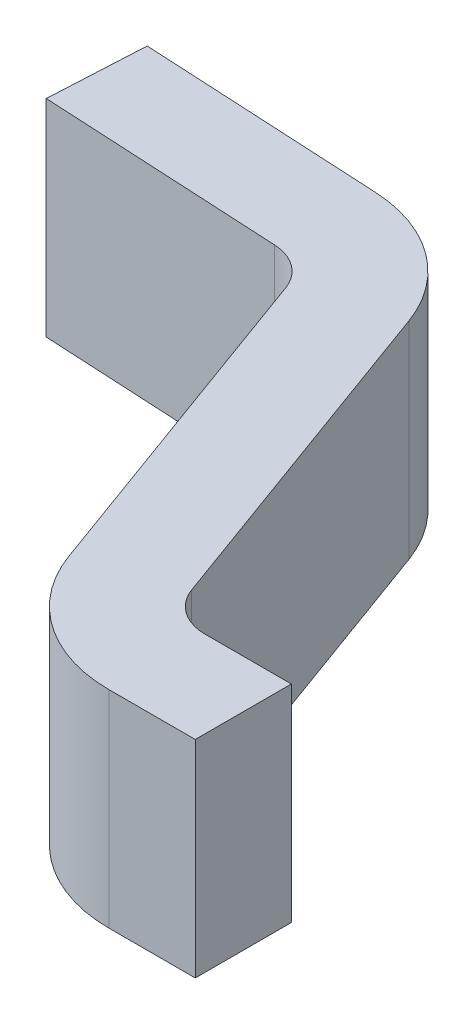
ISO-10303-21;
HEADER;
FILE_DESCRIPTION(('STEP AP214'),'2;1');
FILE_NAME('part.step','',(''),(''),'','','');
FILE_SCHEMA(('AUTOMOTIVE_DESIGN { 1 0 10303 214 1 1 1 1 }'));
ENDSEC;
DATA;
#1=APPLICATION_CONTEXT('core data for automotive mechanical design processes');
#2=APPLICATION_PROTOCOL_DEFINITION('international standard','automotive_design',2000,#1);
#3=PRODUCT_CONTEXT('',#1,'mechanical');
#4=PRODUCT('Part','Part','',(#3));
#5=PRODUCT_RELATED_PRODUCT_CATEGORY('part','',(#4));
#6=PRODUCT_DEFINITION_FORMATION('','',#4);
#7=PRODUCT_DEFINITION_CONTEXT('part definition',#1,'design');
#8=PRODUCT_DEFINITION('design','',#6,#7);
#9=PRODUCT_DEFINITION_SHAPE('','',#8);
#10=(LENGTH_UNIT() NAMED_UNIT(*) SI_UNIT(.MILLI.,.METRE.));
#11=(NAMED_UNIT(*) PLANE_ANGLE_UNIT() SI_UNIT($,.RADIAN.));
#12=(NAMED_UNIT(*) SI_UNIT($,.STERADIAN.) SOLID_ANGLE_UNIT());
#13=UNCERTAINTY_MEASURE_WITH_UNIT(LENGTH_MEASURE(1.E-05),#10,'distance_accuracy_value','');
#14=(GEOMETRIC_REPRESENTATION_CONTEXT(3) GLOBAL_UNCERTAINTY_ASSIGNED_CONTEXT((#13)) GLOBAL_UNIT_ASSIGNED_CONTEXT((#10,
#11,#12)) REPRESENTATION_CONTEXT('',''));
#15=CARTESIAN_POINT('',(0.,0.,0.));
#16=DIRECTION('',(0.,0.,1.));
#17=DIRECTION('',(1.,0.,0.));
#18=AXIS2_PLACEMENT_3D('',#15,#16,#17);
#19=CARTESIAN_POINT('',(0.48600567211583,0.,0.323785336125864));
#20=DIRECTION('',(0.,-1.,0.));
#21=DIRECTION('',(0.,0.,-1.));
#22=AXIS2_PLACEMENT_3D('',#19,#20,#21);
#23=PLANE('',#22);
#24=DIRECTION('',(0.998629534754574,0.,0.052335956242944));
#25=VECTOR('',#24,1.);
#26=CARTESIAN_POINT('',(0.491239267740124,0.,0.223922382650406));
#27=LINE('',#26,#25);
#28=CARTESIAN_POINT('',(-0.010467191248589,0.,0.19762906128285));
#29=VERTEX_POINT('',#28);
#30=CARTESIAN_POINT('',(0.491239267740124,0.,0.223922382650406));
#31=VERTEX_POINT('',#30);
#32=EDGE_CURVE('E149',#29,#31,#27,.T.);
#33=ORIENTED_EDGE('',*,*,#32,.T.);
#34=CARTESIAN_POINT('',(0.48600567211583,0.,0.323785336125864));
#35=DIRECTION('',(0.,-1.,0.));
#36=DIRECTION('',(0.,0.,1.));
#37=AXIS2_PLACEMENT_3D('',#34,#35,#36);
#38=CIRCLE('',#37,0.1);
#39=CARTESIAN_POINT('',(0.57997493419442,0.,0.289583321793297));
#40=VERTEX_POINT('',#39);
#41=EDGE_CURVE('E160',#31,#40,#38,.T.);
#42=ORIENTED_EDGE('',*,*,#41,.T.);
#43=DIRECTION('',(0.342020143325669,0.,0.939692620785908));
#44=VECTOR('',#43,1.);
#45=CARTESIAN_POINT('',(0.838730791659287,0.,1.00050919732964));
#46=LINE('',#45,#44);
#47=CARTESIAN_POINT('',(0.838730791659286,0.,1.00050919732964));
#48=VERTEX_POINT('',#47);
#49=EDGE_CURVE('E159',#40,#48,#46,.T.);
#50=ORIENTED_EDGE('',*,*,#49,.T.);
#51=CARTESIAN_POINT('',(1.12063857789506,0.,0.897903154331935));
#52=DIRECTION('',(0.,-1.,0.));
#53=DIRECTION('',(0.,0.,1.));
#54=AXIS2_PLACEMENT_3D('',#51,#52,#53);
#55=CIRCLE('',#54,0.3);
#56=CARTESIAN_POINT('',(1.12063857789506,0.,1.19790315433193));
#57=VERTEX_POINT('',#56);
#58=EDGE_CURVE('E196',#57,#48,#55,.T.);
#59=ORIENTED_EDGE('',*,*,#58,.F.);
#60=DIRECTION('',(1.,0.,0.));
#61=VECTOR('',#60,1.);
#62=CARTESIAN_POINT('',(1.3,0.,1.19790315433193));
#63=LINE('',#62,#61);
#64=CARTESIAN_POINT('',(1.3,0.,1.19790315433193));
#65=VERTEX_POINT('',#64);
#66=EDGE_CURVE('E207',#57,#65,#63,.T.);
#67=ORIENTED_EDGE('',*,*,#66,.T.);
#68=DIRECTION('',(0.,0.,-1.));
#69=VECTOR('',#68,1.);
#70=CARTESIAN_POINT('',(1.3,0.,0.997903154331935));
#71=LINE('',#70,#69);
#72=CARTESIAN_POINT('',(1.3,0.,0.997903154331935));
#73=VERTEX_POINT('',#72);
#74=EDGE_CURVE('E225',#65,#73,#71,.T.);
#75=ORIENTED_EDGE('',*,*,#74,.T.);
#76=DIRECTION('',(-1.,0.,0.));
#77=VECTOR('',#76,1.);
#78=CARTESIAN_POINT('',(1.12063857789506,0.,0.997903154331935));
#79=LINE('',#78,#77);
#80=CARTESIAN_POINT('',(1.12063857789506,0.,0.997903154331935));
#81=VERTEX_POINT('',#80);
#82=EDGE_CURVE('E165',#73,#81,#79,.T.);
#83=ORIENTED_EDGE('',*,*,#82,.T.);
#84=CARTESIAN_POINT('',(1.12063857789506,0.,0.897903154331935));
#85=DIRECTION('',(0.,-1.,0.));
#86=DIRECTION('',(0.,0.,1.));
#87=AXIS2_PLACEMENT_3D('',#84,#85,#86);
#88=CIRCLE('',#87,0.1);
#89=CARTESIAN_POINT('',(1.02666931581647,0.,0.932105168664502));
#90=VERTEX_POINT('',#89);
#91=EDGE_CURVE('E164',#81,#90,#88,.T.);
#92=ORIENTED_EDGE('',*,*,#91,.T.);
#93=DIRECTION('',(-0.342020143325669,0.,-0.939692620785908));
#94=VECTOR('',#93,1.);
#95=CARTESIAN_POINT('',(0.767913458351602,0.,0.221179293128163));
#96=LINE('',#95,#94);
#97=CARTESIAN_POINT('',(0.767913458351602,0.,0.221179293128163));
#98=VERTEX_POINT('',#97);
#99=EDGE_CURVE('E123',#90,#98,#96,.T.);
#100=ORIENTED_EDGE('',*,*,#99,.T.);
#101=CARTESIAN_POINT('',(0.48600567211583,0.,0.323785336125864));
#102=DIRECTION('',(0.,-1.,0.));
#103=DIRECTION('',(0.,0.,1.));
#104=AXIS2_PLACEMENT_3D('',#101,#102,#103);
#105=CIRCLE('',#104,0.3);
#106=CARTESIAN_POINT('',(0.501706458988713,0.,0.0241964756994916));
#107=VERTEX_POINT('',#106);
#108=EDGE_CURVE('E122',#107,#98,#105,.T.);
#109=ORIENTED_EDGE('',*,*,#108,.F.);
#110=DIRECTION('',(-0.998629534754574,0.,-0.052335956242944));
#111=VECTOR('',#110,1.);
#112=CARTESIAN_POINT('',(0.,0.,-0.00209684566806524));
#113=LINE('',#112,#111);
#114=CARTESIAN_POINT('',(0.,0.,-0.00209684566806525));
#115=VERTEX_POINT('',#114);
#116=EDGE_CURVE('E26',#107,#115,#113,.T.);
#117=ORIENTED_EDGE('',*,*,#116,.T.);
#118=DIRECTION('',(-0.0523359562429441,0.,0.998629534754574));
#119=VECTOR('',#118,1.);
#120=CARTESIAN_POINT('',(-0.0104671912485889,0.,0.19762906128285));
#121=LINE('',#120,#119);
#122=EDGE_CURVE('E11',#115,#29,#121,.T.);
#123=ORIENTED_EDGE('',*,*,#122,.T.);
#124=EDGE_LOOP('',(#33,#42,#50,#59,#67,#75,#83,#92,#100,#109,#117,#123));
#125=FACE_BOUND('',#124,.T.);
#126=ADVANCED_FACE('F16',(#125),#23,.F.);
#127=CARTESIAN_POINT('',(-0.0104671912485889,-0.43,0.19762906128285));
#128=DIRECTION('',(0.998629534754574,0.,0.0523359562429441));
#129=DIRECTION('',(0.,-1.,0.));
#130=AXIS2_PLACEMENT_3D('',#127,#128,#129);
#131=PLANE('',#130);
#132=DIRECTION('',(0.,-1.,0.));
#133=VECTOR('',#132,1.);
#134=CARTESIAN_POINT('',(0.,-0.43,-0.00209684566806524));
#135=LINE('',#134,#133);
#136=CARTESIAN_POINT('',(0.,-0.43,-0.00209684566806522));
#137=VERTEX_POINT('',#136);
#138=EDGE_CURVE('E227',#115,#137,#135,.T.);
#139=ORIENTED_EDGE('',*,*,#138,.T.);
#140=DIRECTION('',(0.0523359562429436,0.,-0.998629534754574));
#141=VECTOR('',#140,1.);
#142=CARTESIAN_POINT('',(-0.0104671912485889,-0.43,0.19762906128285));
#143=LINE('',#142,#141);
#144=CARTESIAN_POINT('',(-0.0104671912485889,-0.43,0.19762906128285));
#145=VERTEX_POINT('',#144);
#146=EDGE_CURVE('E137',#145,#137,#143,.T.);
#147=ORIENTED_EDGE('',*,*,#146,.F.);
#148=DIRECTION('',(0.,1.,0.));
#149=VECTOR('',#148,1.);
#150=CARTESIAN_POINT('',(-0.010467191248589,-0.43,0.197629061282849));
#151=LINE('',#150,#149);
#152=EDGE_CURVE('E169',#145,#29,#151,.T.);
#153=ORIENTED_EDGE('',*,*,#152,.T.);
#154=ORIENTED_EDGE('',*,*,#122,.F.);
#155=EDGE_LOOP('',(#139,#147,#153,#154));
#156=FACE_BOUND('',#155,.T.);
#157=ADVANCED_FACE('F302',(#156),#131,.F.);
#158=CARTESIAN_POINT('',(0.,-0.43,-0.00209684566806524));
#159=DIRECTION('',(-0.052335956242944,0.,0.998629534754574));
#160=DIRECTION('',(0.,1.,0.));
#161=AXIS2_PLACEMENT_3D('',#158,#159,#160);
#162=PLANE('',#161);
#163=DIRECTION('',(0.,1.,0.));
#164=VECTOR('',#163,1.);
#165=CARTESIAN_POINT('',(0.501706458988713,-0.43,0.0241964756994918));
#166=LINE('',#165,#164);
#167=CARTESIAN_POINT('',(0.501706458988713,-0.43,0.0241964756994917));
#168=VERTEX_POINT('',#167);
#169=EDGE_CURVE('E114',#168,#107,#166,.T.);
#170=ORIENTED_EDGE('',*,*,#169,.F.);
#171=DIRECTION('',(0.998629534754574,0.,0.0523359562429439));
#172=VECTOR('',#171,1.);
#173=CARTESIAN_POINT('',(0.,-0.43,-0.00209684566806519));
#174=LINE('',#173,#172);
#175=EDGE_CURVE('E118',#137,#168,#174,.T.);
#176=ORIENTED_EDGE('',*,*,#175,.F.);
#177=ORIENTED_EDGE('',*,*,#138,.F.);
#178=ORIENTED_EDGE('',*,*,#116,.F.);
#179=EDGE_LOOP('',(#170,#176,#177,#178));
#180=FACE_BOUND('',#179,.T.);
#181=ADVANCED_FACE('F115',(#180),#162,.F.);
#182=CARTESIAN_POINT('',(0.48600567211583,-0.43,0.323785336125864));
#183=DIRECTION('',(0.,1.,0.));
#184=DIRECTION('',(0.,0.,1.));
#185=AXIS2_PLACEMENT_3D('',#182,#183,#184);
#186=CYLINDRICAL_SURFACE('',#185,0.3);
#187=CARTESIAN_POINT('',(0.48600567211583,-0.43,0.323785336125864));
#188=DIRECTION('',(0.,-1.,0.));
#189=DIRECTION('',(0.,0.,1.));
#190=AXIS2_PLACEMENT_3D('',#187,#188,#189);
#191=CIRCLE('',#190,0.3);
#192=CARTESIAN_POINT('',(0.767913458351602,-0.43,0.221179293128163));
#193=VERTEX_POINT('',#192);
#194=EDGE_CURVE('E126',#168,#193,#191,.T.);
#195=ORIENTED_EDGE('',*,*,#194,.F.);
#196=ORIENTED_EDGE('',*,*,#169,.T.);
#197=ORIENTED_EDGE('',*,*,#108,.T.);
#198=DIRECTION('',(0.,-1.,0.));
#199=VECTOR('',#198,1.);
#200=CARTESIAN_POINT('',(0.767913458351602,-0.43,0.221179293128163));
#201=LINE('',#200,#199);
#202=EDGE_CURVE('E105',#98,#193,#201,.T.);
#203=ORIENTED_EDGE('',*,*,#202,.T.);
#204=EDGE_LOOP('',(#195,#196,#197,#203));
#205=FACE_BOUND('',#204,.T.);
#206=ADVANCED_FACE('F127',(#205),#186,.T.);
#207=CARTESIAN_POINT('',(0.767913458351602,-0.43,0.221179293128163));
#208=DIRECTION('',(-0.939692620785908,0.,0.342020143325669));
#209=DIRECTION('',(0.,1.,0.));
#210=AXIS2_PLACEMENT_3D('',#207,#208,#209);
#211=PLANE('',#210);
#212=DIRECTION('',(0.,-1.,0.));
#213=VECTOR('',#212,1.);
#214=CARTESIAN_POINT('',(1.02666931581647,-0.43,0.932105168664502));
#215=LINE('',#214,#213);
#216=CARTESIAN_POINT('',(1.02666931581647,-0.43,0.932105168664502));
#217=VERTEX_POINT('',#216);
#218=EDGE_CURVE('E161',#90,#217,#215,.T.);
#219=ORIENTED_EDGE('',*,*,#218,.T.);
#220=DIRECTION('',(0.342020143325671,0.,0.939692620785908));
#221=VECTOR('',#220,1.);
#222=CARTESIAN_POINT('',(0.767913458351602,-0.43,0.221179293128163));
#223=LINE('',#222,#221);
#224=EDGE_CURVE('E131',#193,#217,#223,.T.);
#225=ORIENTED_EDGE('',*,*,#224,.F.);
#226=ORIENTED_EDGE('',*,*,#202,.F.);
#227=ORIENTED_EDGE('',*,*,#99,.F.);
#228=EDGE_LOOP('',(#219,#225,#226,#227));
#229=FACE_BOUND('',#228,.T.);
#230=ADVANCED_FACE('F301',(#229),#211,.F.);
#231=CARTESIAN_POINT('',(1.12063857789506,-0.43,0.897903154331935));
#232=DIRECTION('',(0.,1.,0.));
#233=DIRECTION('',(0.,0.,1.));
#234=AXIS2_PLACEMENT_3D('',#231,#232,#233);
#235=CYLINDRICAL_SURFACE('',#234,0.1);
#236=DIRECTION('',(0.,-1.,0.));
#237=VECTOR('',#236,1.);
#238=CARTESIAN_POINT('',(1.12063857789506,-0.43,0.997903154331935));
#239=LINE('',#238,#237);
#240=CARTESIAN_POINT('',(1.12063857789506,-0.43,0.997903154331935));
#241=VERTEX_POINT('',#240);
#242=EDGE_CURVE('E218',#81,#241,#239,.T.);
#243=ORIENTED_EDGE('',*,*,#242,.T.);
#244=CARTESIAN_POINT('',(1.12063857789506,-0.43,0.897903154331935));
#245=DIRECTION('',(0.,1.,0.));
#246=DIRECTION('',(0.,0.,1.));
#247=AXIS2_PLACEMENT_3D('',#244,#245,#246);
#248=CIRCLE('',#247,0.1);
#249=EDGE_CURVE('E184',#217,#241,#248,.T.);
#250=ORIENTED_EDGE('',*,*,#249,.F.);
#251=ORIENTED_EDGE('',*,*,#218,.F.);
#252=ORIENTED_EDGE('',*,*,#91,.F.);
#253=EDGE_LOOP('',(#243,#250,#251,#252));
#254=FACE_BOUND('',#253,.T.);
#255=ADVANCED_FACE('F296',(#254),#235,.F.);
#256=CARTESIAN_POINT('',(1.12063857789506,-0.43,0.997903154331935));
#257=DIRECTION('',(0.,0.,1.));
#258=DIRECTION('',(1.,0.,0.));
#259=AXIS2_PLACEMENT_3D('',#256,#257,#258);
#260=PLANE('',#259);
#261=DIRECTION('',(0.,-1.,0.));
#262=VECTOR('',#261,1.);
#263=CARTESIAN_POINT('',(1.3,-0.43,0.997903154331935));
#264=LINE('',#263,#262);
#265=CARTESIAN_POINT('',(1.3,-0.43,0.997903154331935));
#266=VERTEX_POINT('',#265);
#267=EDGE_CURVE('E211',#73,#266,#264,.T.);
#268=ORIENTED_EDGE('',*,*,#267,.T.);
#269=DIRECTION('',(1.,0.,0.));
#270=VECTOR('',#269,1.);
#271=CARTESIAN_POINT('',(0.48600567211583,-0.43,0.997903154331935));
#272=LINE('',#271,#270);
#273=EDGE_CURVE('E179',#241,#266,#272,.T.);
#274=ORIENTED_EDGE('',*,*,#273,.F.);
#275=ORIENTED_EDGE('',*,*,#242,.F.);
#276=ORIENTED_EDGE('',*,*,#82,.F.);
#277=EDGE_LOOP('',(#268,#274,#275,#276));
#278=FACE_BOUND('',#277,.T.);
#279=ADVANCED_FACE('F298',(#278),#260,.F.);
#280=CARTESIAN_POINT('',(1.3,-0.43,0.997903154331935));
#281=DIRECTION('',(-1.,0.,0.));
#282=DIRECTION('',(0.,0.,1.));
#283=AXIS2_PLACEMENT_3D('',#280,#281,#282);
#284=PLANE('',#283);
#285=DIRECTION('',(0.,-1.,0.));
#286=VECTOR('',#285,1.);
#287=CARTESIAN_POINT('',(1.3,-0.43,1.19790315433193));
#288=LINE('',#287,#286);
#289=CARTESIAN_POINT('',(1.3,-0.43,1.19790315433193));
#290=VERTEX_POINT('',#289);
#291=EDGE_CURVE('E200',#65,#290,#288,.T.);
#292=ORIENTED_EDGE('',*,*,#291,.T.);
#293=DIRECTION('',(0.,0.,1.));
#294=VECTOR('',#293,1.);
#295=CARTESIAN_POINT('',(1.3,-0.43,0.323785336125864));
#296=LINE('',#295,#294);
#297=EDGE_CURVE('E183',#266,#290,#296,.T.);
#298=ORIENTED_EDGE('',*,*,#297,.F.);
#299=ORIENTED_EDGE('',*,*,#267,.F.);
#300=ORIENTED_EDGE('',*,*,#74,.F.);
#301=EDGE_LOOP('',(#292,#298,#299,#300));
#302=FACE_BOUND('',#301,.T.);
#303=ADVANCED_FACE('F477',(#302),#284,.F.);
#304=CARTESIAN_POINT('',(1.3,-0.43,1.19790315433193));
#305=DIRECTION('',(0.,0.,-1.));
#306=DIRECTION('',(-1.,0.,0.));
#307=AXIS2_PLACEMENT_3D('',#304,#305,#306);
#308=PLANE('',#307);
#309=DIRECTION('',(0.,1.,0.));
#310=VECTOR('',#309,1.);
#311=CARTESIAN_POINT('',(1.12063857789506,-0.43,1.19790315433193));
#312=LINE('',#311,#310);
#313=CARTESIAN_POINT('',(1.12063857789506,-0.43,1.19790315433193));
#314=VERTEX_POINT('',#313);
#315=EDGE_CURVE('E192',#314,#57,#312,.T.);
#316=ORIENTED_EDGE('',*,*,#315,.F.);
#317=DIRECTION('',(-1.,0.,0.));
#318=VECTOR('',#317,1.);
#319=CARTESIAN_POINT('',(0.48600567211583,-0.43,1.19790315433193));
#320=LINE('',#319,#318);
#321=EDGE_CURVE('E185',#290,#314,#320,.T.);
#322=ORIENTED_EDGE('',*,*,#321,.F.);
#323=ORIENTED_EDGE('',*,*,#291,.F.);
#324=ORIENTED_EDGE('',*,*,#66,.F.);
#325=EDGE_LOOP('',(#316,#322,#323,#324));
#326=FACE_BOUND('',#325,.T.);
#327=ADVANCED_FACE('F18',(#326),#308,.F.);
#328=CARTESIAN_POINT('',(1.12063857789506,-0.43,0.897903154331935));
#329=DIRECTION('',(0.,1.,0.));
#330=DIRECTION('',(0.,0.,1.));
#331=AXIS2_PLACEMENT_3D('',#328,#329,#330);
#332=CYLINDRICAL_SURFACE('',#331,0.3);
#333=CARTESIAN_POINT('',(1.12063857789506,-0.43,0.897903154331935));
#334=DIRECTION('',(0.,-1.,0.));
#335=DIRECTION('',(0.,0.,1.));
#336=AXIS2_PLACEMENT_3D('',#333,#334,#335);
#337=CIRCLE('',#336,0.3);
#338=CARTESIAN_POINT('',(0.838730791659286,-0.43,1.00050919732964));
#339=VERTEX_POINT('',#338);
#340=EDGE_CURVE('E178',#314,#339,#337,.T.);
#341=ORIENTED_EDGE('',*,*,#340,.F.);
#342=ORIENTED_EDGE('',*,*,#315,.T.);
#343=ORIENTED_EDGE('',*,*,#58,.T.);
#344=DIRECTION('',(0.,-1.,0.));
#345=VECTOR('',#344,1.);
#346=CARTESIAN_POINT('',(0.838730791659287,-0.43,1.00050919732964));
#347=LINE('',#346,#345);
#348=EDGE_CURVE('E155',#48,#339,#347,.T.);
#349=ORIENTED_EDGE('',*,*,#348,.T.);
#350=EDGE_LOOP('',(#341,#342,#343,#349));
#351=FACE_BOUND('',#350,.T.);
#352=ADVANCED_FACE('F280',(#351),#332,.T.);
#353=CARTESIAN_POINT('',(0.838730791659287,-0.43,1.00050919732964));
#354=DIRECTION('',(0.939692620785908,0.,-0.342020143325669));
#355=DIRECTION('',(0.,-1.,0.));
#356=AXIS2_PLACEMENT_3D('',#353,#354,#355);
#357=PLANE('',#356);
#358=DIRECTION('',(0.,-1.,0.));
#359=VECTOR('',#358,1.);
#360=CARTESIAN_POINT('',(0.579974934194421,-0.43,0.289583321793297));
#361=LINE('',#360,#359);
#362=CARTESIAN_POINT('',(0.579974934194421,-0.43,0.289583321793297));
#363=VERTEX_POINT('',#362);
#364=EDGE_CURVE('E153',#40,#363,#361,.T.);
#365=ORIENTED_EDGE('',*,*,#364,.T.);
#366=DIRECTION('',(-0.342020143325667,0.,-0.939692620785909));
#367=VECTOR('',#366,1.);
#368=CARTESIAN_POINT('',(0.838730791659287,-0.43,1.00050919732964));
#369=LINE('',#368,#367);
#370=EDGE_CURVE('E172',#339,#363,#369,.T.);
#371=ORIENTED_EDGE('',*,*,#370,.F.);
#372=ORIENTED_EDGE('',*,*,#348,.F.);
#373=ORIENTED_EDGE('',*,*,#49,.F.);
#374=EDGE_LOOP('',(#365,#371,#372,#373));
#375=FACE_BOUND('',#374,.T.);
#376=ADVANCED_FACE('F274',(#375),#357,.F.);
#377=CARTESIAN_POINT('',(0.48600567211583,-0.43,0.323785336125864));
#378=DIRECTION('',(0.,1.,0.));
#379=DIRECTION('',(0.,0.,1.));
#380=AXIS2_PLACEMENT_3D('',#377,#378,#379);
#381=CYLINDRICAL_SURFACE('',#380,0.1);
#382=DIRECTION('',(0.,-1.,0.));
#383=VECTOR('',#382,1.);
#384=CARTESIAN_POINT('',(0.491239267740124,-0.43,0.223922382650406));
#385=LINE('',#384,#383);
#386=CARTESIAN_POINT('',(0.491239267740124,-0.43,0.223922382650406));
#387=VERTEX_POINT('',#386);
#388=EDGE_CURVE('E154',#31,#387,#385,.T.);
#389=ORIENTED_EDGE('',*,*,#388,.T.);
#390=CARTESIAN_POINT('',(0.48600567211583,-0.43,0.323785336125864));
#391=DIRECTION('',(0.,1.,0.));
#392=DIRECTION('',(0.,0.,1.));
#393=AXIS2_PLACEMENT_3D('',#390,#391,#392);
#394=CIRCLE('',#393,0.1);
#395=EDGE_CURVE('E189',#363,#387,#394,.T.);
#396=ORIENTED_EDGE('',*,*,#395,.F.);
#397=ORIENTED_EDGE('',*,*,#364,.F.);
#398=ORIENTED_EDGE('',*,*,#41,.F.);
#399=EDGE_LOOP('',(#389,#396,#397,#398));
#400=FACE_BOUND('',#399,.T.);
#401=ADVANCED_FACE('F271',(#400),#381,.F.);
#402=CARTESIAN_POINT('',(0.491239267740124,-0.43,0.223922382650406));
#403=DIRECTION('',(0.052335956242944,0.,-0.998629534754574));
#404=DIRECTION('',(0.,-1.,0.));
#405=AXIS2_PLACEMENT_3D('',#402,#403,#404);
#406=PLANE('',#405);
#407=ORIENTED_EDGE('',*,*,#152,.F.);
#408=DIRECTION('',(-0.998629534754574,0.,-0.0523359562429426));
#409=VECTOR('',#408,1.);
#410=CARTESIAN_POINT('',(0.491239267740124,-0.43,0.223922382650406));
#411=LINE('',#410,#409);
#412=EDGE_CURVE('E144',#387,#145,#411,.T.);
#413=ORIENTED_EDGE('',*,*,#412,.F.);
#414=ORIENTED_EDGE('',*,*,#388,.F.);
#415=ORIENTED_EDGE('',*,*,#32,.F.);
#416=EDGE_LOOP('',(#407,#413,#414,#415));
#417=FACE_BOUND('',#416,.T.);
#418=ADVANCED_FACE('F416',(#417),#406,.F.);
#419=CARTESIAN_POINT('',(0.48600567211583,-0.43,0.323785336125864));
#420=DIRECTION('',(0.,-1.,0.));
#421=DIRECTION('',(0.,0.,-1.));
#422=AXIS2_PLACEMENT_3D('',#419,#420,#421);
#423=PLANE('',#422);
#424=ORIENTED_EDGE('',*,*,#395,.T.);
#425=ORIENTED_EDGE('',*,*,#412,.T.);
#426=ORIENTED_EDGE('',*,*,#146,.T.);
#427=ORIENTED_EDGE('',*,*,#175,.T.);
#428=ORIENTED_EDGE('',*,*,#194,.T.);
#429=ORIENTED_EDGE('',*,*,#224,.T.);
#430=ORIENTED_EDGE('',*,*,#249,.T.);
#431=ORIENTED_EDGE('',*,*,#273,.T.);
#432=ORIENTED_EDGE('',*,*,#297,.T.);
#433=ORIENTED_EDGE('',*,*,#321,.T.);
#434=ORIENTED_EDGE('',*,*,#340,.T.);
#435=ORIENTED_EDGE('',*,*,#370,.T.);
#436=EDGE_LOOP('',(#424,#425,#426,#427,#428,#429,#430,#431,#432,#433,#434,#435));
#437=FACE_BOUND('',#436,.T.);
#438=ADVANCED_FACE('F134',(#437),#423,.T.);
#439=CLOSED_SHELL('',(#126,#157,#181,#206,#230,#255,#279,#303,#327,#352,#376,#401,#418,#438));
#440=MANIFOLD_SOLID_BREP('B1',#439);
#441=ADVANCED_BREP_SHAPE_REPRESENTATION('',(#18,#440),#14);
#442=SHAPE_DEFINITION_REPRESENTATION(#9,#441);
ENDSEC;
END-ISO-10303-21;
